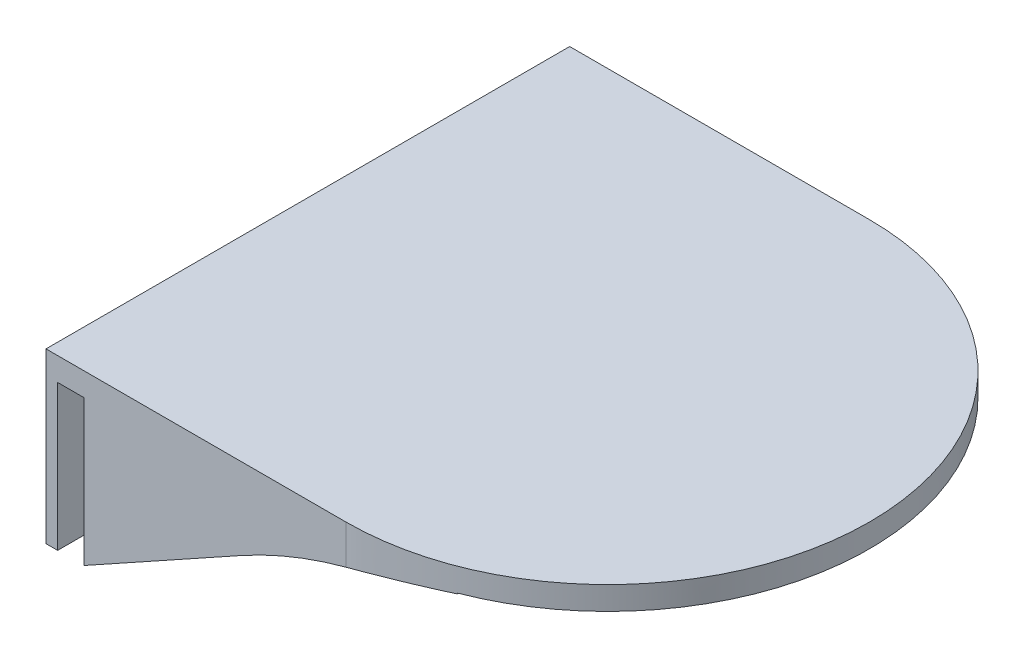
ISO-10303-21;
HEADER;
FILE_DESCRIPTION(('STEP AP214'),'2;1');
FILE_NAME('part.step','',(''),(''),'','','');
FILE_SCHEMA(('AUTOMOTIVE_DESIGN { 1 0 10303 214 1 1 1 1 }'));
ENDSEC;
DATA;
#1=APPLICATION_CONTEXT('core data for automotive mechanical design processes');
#2=APPLICATION_PROTOCOL_DEFINITION('international standard','automotive_design',2000,#1);
#3=PRODUCT_CONTEXT('',#1,'mechanical');
#4=PRODUCT('Part','Part','',(#3));
#5=PRODUCT_RELATED_PRODUCT_CATEGORY('part','',(#4));
#6=PRODUCT_DEFINITION_FORMATION('','',#4);
#7=PRODUCT_DEFINITION_CONTEXT('part definition',#1,'design');
#8=PRODUCT_DEFINITION('design','',#6,#7);
#9=PRODUCT_DEFINITION_SHAPE('','',#8);
#10=(LENGTH_UNIT() NAMED_UNIT(*) SI_UNIT(.MILLI.,.METRE.));
#11=(NAMED_UNIT(*) PLANE_ANGLE_UNIT() SI_UNIT($,.RADIAN.));
#12=(NAMED_UNIT(*) SI_UNIT($,.STERADIAN.) SOLID_ANGLE_UNIT());
#13=UNCERTAINTY_MEASURE_WITH_UNIT(LENGTH_MEASURE(1.E-05),#10,'distance_accuracy_value','');
#14=(GEOMETRIC_REPRESENTATION_CONTEXT(3) GLOBAL_UNCERTAINTY_ASSIGNED_CONTEXT((#13)) GLOBAL_UNIT_ASSIGNED_CONTEXT((#10,
#11,#12)) REPRESENTATION_CONTEXT('',''));
#15=CARTESIAN_POINT('',(0.,0.,0.));
#16=DIRECTION('',(0.,0.,1.));
#17=DIRECTION('',(1.,0.,0.));
#18=AXIS2_PLACEMENT_3D('',#15,#16,#17);
#19=CARTESIAN_POINT('',(-90.0820393249937,0.,-208.278936550003));
#20=DIRECTION('',(-1.,0.,0.));
#21=DIRECTION('',(0.,0.,1.));
#22=AXIS2_PLACEMENT_3D('',#19,#20,#21);
#23=PLANE('',#22);
#24=DIRECTION('',(0.,1.,0.));
#25=VECTOR('',#24,1.);
#26=CARTESIAN_POINT('',(-90.0820393249937,0.,-84.));
#27=LINE('',#26,#25);
#28=CARTESIAN_POINT('',(-90.0820393249937,-50.,-84.));
#29=VERTEX_POINT('',#28);
#30=CARTESIAN_POINT('',(-90.0820393249937,0.,-84.));
#31=VERTEX_POINT('',#30);
#32=EDGE_CURVE('E139',#29,#31,#27,.T.);
#33=ORIENTED_EDGE('',*,*,#32,.T.);
#34=DIRECTION('',(0.,0.,1.));
#35=VECTOR('',#34,1.);
#36=CARTESIAN_POINT('',(-90.0820393249937,0.,-208.278936550003));
#37=LINE('',#36,#35);
#38=CARTESIAN_POINT('',(-90.0820393249937,0.,-90.));
#39=VERTEX_POINT('',#38);
#40=EDGE_CURVE('E168',#39,#31,#37,.T.);
#41=ORIENTED_EDGE('',*,*,#40,.F.);
#42=DIRECTION('',(0.,1.,0.));
#43=VECTOR('',#42,1.);
#44=CARTESIAN_POINT('',(-90.0820393249937,0.,-90.));
#45=LINE('',#44,#43);
#46=CARTESIAN_POINT('',(-90.0820393249937,-50.,-90.));
#47=VERTEX_POINT('',#46);
#48=EDGE_CURVE('E161',#47,#39,#45,.T.);
#49=ORIENTED_EDGE('',*,*,#48,.F.);
#50=DIRECTION('',(0.,0.,1.));
#51=VECTOR('',#50,1.);
#52=CARTESIAN_POINT('',(-90.0820393249937,-50.,-208.278936550003));
#53=LINE('',#52,#51);
#54=EDGE_CURVE('E154',#47,#29,#53,.T.);
#55=ORIENTED_EDGE('',*,*,#54,.T.);
#56=EDGE_LOOP('',(#33,#41,#49,#55));
#57=FACE_BOUND('',#56,.T.);
#58=ADVANCED_FACE('F37',(#57),#23,.T.);
#59=CARTESIAN_POINT('',(-90.0820393249937,-50.,-208.278936550003));
#60=DIRECTION('',(0.485304850770635,-0.87434501303461,0.));
#61=DIRECTION('',(0.87434501303461,0.485304850770635,0.));
#62=AXIS2_PLACEMENT_3D('',#59,#60,#61);
#63=PLANE('',#62);
#64=DIRECTION('',(-0.87434501303461,-0.485304850770635,0.));
#65=VECTOR('',#64,1.);
#66=CARTESIAN_POINT('',(-90.0820393249937,-50.,-90.));
#67=LINE('',#66,#65);
#68=CARTESIAN_POINT('',(-36.2216239270331,-20.1047979144624,-90.));
#69=VERTEX_POINT('',#68);
#70=EDGE_CURVE('E196',#69,#47,#67,.T.);
#71=ORIENTED_EDGE('',*,*,#70,.F.);
#72=DIRECTION('',(0.,0.,1.));
#73=VECTOR('',#72,1.);
#74=CARTESIAN_POINT('',(-36.2216239270331,-20.1047979144624,-208.278936550003));
#75=LINE('',#74,#73);
#76=CARTESIAN_POINT('',(-36.2216239270331,-20.1047979144624,-84.));
#77=VERTEX_POINT('',#76);
#78=EDGE_CURVE('E156',#69,#77,#75,.T.);
#79=ORIENTED_EDGE('',*,*,#78,.T.);
#80=DIRECTION('',(0.87434501303461,0.485304850770635,0.));
#81=VECTOR('',#80,1.);
#82=CARTESIAN_POINT('',(-90.0820393249937,-50.,-84.));
#83=LINE('',#82,#81);
#84=EDGE_CURVE('E142',#29,#77,#83,.T.);
#85=ORIENTED_EDGE('',*,*,#84,.F.);
#86=ORIENTED_EDGE('',*,*,#54,.F.);
#87=EDGE_LOOP('',(#71,#79,#85,#86));
#88=FACE_BOUND('',#87,.T.);
#89=ADVANCED_FACE('F153',(#88),#63,.T.);
#90=CARTESIAN_POINT('',(0.,8.,0.));
#91=DIRECTION('',(0.,-1.,0.));
#92=DIRECTION('',(0.,0.,-1.));
#93=AXIS2_PLACEMENT_3D('',#90,#91,#92);
#94=CYLINDRICAL_SURFACE('',#93,90.);
#95=DIRECTION('',(0.,-1.,0.));
#96=VECTOR('',#95,1.);
#97=CARTESIAN_POINT('',(0.,8.,90.));
#98=LINE('',#97,#96);
#99=CARTESIAN_POINT('',(0.,8.,90.));
#100=VERTEX_POINT('',#99);
#101=CARTESIAN_POINT('',(0.,-5.45618400949456,90.));
#102=VERTEX_POINT('',#101);
#103=EDGE_CURVE('E57',#100,#102,#98,.T.);
#104=ORIENTED_EDGE('',*,*,#103,.T.);
#105=CARTESIAN_POINT('',(0.,-5.45618400949456,90.));
#106=CARTESIAN_POINT('',(0.676579032918027,-5.27481793973442,90.0000005999302));
#107=CARTESIAN_POINT('',(1.3543216190302,-5.09790618018332,89.9923700488413));
#108=CARTESIAN_POINT('',(2.71175054397955,-4.7530740532775,89.9616992498719));
#109=CARTESIAN_POINT('',(3.39143690525018,-4.58515379013996,89.938658823423));
#110=CARTESIAN_POINT('',(5.43276961012315,-4.09502098527022,89.8462038634848));
#111=CARTESIAN_POINT('',(6.79673280708392,-3.78642484166299,89.7534556682142));
#112=CARTESIAN_POINT('',(9.51187896592084,-3.20930838894645,89.5062146375457));
#113=CARTESIAN_POINT('',(10.8630398932317,-2.94038932600334,89.3524031462073));
#114=CARTESIAN_POINT('',(13.563562177461,-2.43888090337245,88.982509619888));
#115=CARTESIAN_POINT('',(14.9129235873578,-2.20629044965611,88.766429460673));
#116=CARTESIAN_POINT('',(17.6120449134313,-1.77637143924052,88.2706470579383));
#117=CARTESIAN_POINT('',(18.9617789381,-1.57920741285122,87.9906610059642));
#118=CARTESIAN_POINT('',(21.6514911165541,-1.22102112115672,87.3677214440218));
#119=CARTESIAN_POINT('',(22.9914690357166,-1.05999972227997,87.0247664248895));
#120=CARTESIAN_POINT('',(25.6724294002178,-0.771780067179688,86.2721614615952));
#121=CARTESIAN_POINT('',(27.0132602687289,-0.644973990699274,85.8618183553604));
#122=CARTESIAN_POINT('',(29.0108008517467,-0.48109538342923,85.1989782895893));
#123=CARTESIAN_POINT('',(29.674389176877,-0.430856145313428,84.9701341322484));
#124=CARTESIAN_POINT('',(30.9965531919549,-0.338978536110794,84.4967852121419));
#125=CARTESIAN_POINT('',(31.655128908226,-0.297340119827178,84.2522805316802));
#126=CARTESIAN_POINT('',(32.3109888428071,-0.259912464926287,84.));
#127=B_SPLINE_CURVE_WITH_KNOTS('',3,(#105,#106,#107,#108,#109,#110,#111,#112,#113,#114,#115,
#116,#117,#118,#119,#120,#121,#122,#123,#124,#125,#126),.UNSPECIFIED.,.F.,.F.,(4,2,2,2,2,2,2,2,
2,2,4),(0.,2.10128105442194,4.20258645876373,8.40506315411791,12.5619102736507,16.718632186445,
20.8941863799632,25.0698406611863,29.2914988320922,31.4024934694823,33.5134770134444),.UNSPECIFIED.);
#128=CARTESIAN_POINT('',(32.3109888428071,-0.259912464926287,84.));
#129=VERTEX_POINT('',#128);
#130=EDGE_CURVE('E53',#102,#129,#127,.T.);
#131=ORIENTED_EDGE('',*,*,#130,.T.);
#132=DIRECTION('',(0.,-1.,0.));
#133=VECTOR('',#132,1.);
#134=CARTESIAN_POINT('',(32.3109888428071,-0.259912464926287,84.));
#135=LINE('',#134,#133);
#136=CARTESIAN_POINT('',(32.310988842807,0.,84.));
#137=VERTEX_POINT('',#136);
#138=EDGE_CURVE('E11',#137,#129,#135,.T.);
#139=ORIENTED_EDGE('',*,*,#138,.F.);
#140=CARTESIAN_POINT('',(0.,0.,0.));
#141=DIRECTION('',(0.,1.,0.));
#142=DIRECTION('',(0.,0.,1.));
#143=AXIS2_PLACEMENT_3D('',#140,#141,#142);
#144=CIRCLE('',#143,90.);
#145=CARTESIAN_POINT('',(32.310988842807,0.,-84.));
#146=VERTEX_POINT('',#145);
#147=EDGE_CURVE('E192',#137,#146,#144,.T.);
#148=ORIENTED_EDGE('',*,*,#147,.T.);
#149=DIRECTION('',(0.,-1.,0.));
#150=VECTOR('',#149,1.);
#151=CARTESIAN_POINT('',(32.310988842807,0.,-84.));
#152=LINE('',#151,#150);
#153=CARTESIAN_POINT('',(32.310988842807,-0.259912464926293,-84.));
#154=VERTEX_POINT('',#153);
#155=EDGE_CURVE('E46',#146,#154,#152,.T.);
#156=ORIENTED_EDGE('',*,*,#155,.T.);
#157=CARTESIAN_POINT('',(32.310988842807,-0.259912464926293,-84.));
#158=CARTESIAN_POINT('',(31.6586132645872,-0.297141300308556,-84.2509402406203));
#159=CARTESIAN_POINT('',(31.0035505188139,-0.338536252174855,-84.4941871180927));
#160=CARTESIAN_POINT('',(29.6884630674686,-0.429834885303179,-84.9651870305295));
#161=CARTESIAN_POINT('',(29.0284383364911,-0.479738610158548,-85.1929399861049));
#162=CARTESIAN_POINT('',(27.0416561542902,-0.642468346147607,-85.8527582359676));
#163=CARTESIAN_POINT('',(25.708085825319,-0.76831884020531,-86.2614232426045));
#164=CARTESIAN_POINT('',(23.0415962502401,-1.05425433048062,-87.0113926254637));
#165=CARTESIAN_POINT('',(21.7088266773,-1.21395339872803,-87.3533792303636));
#166=CARTESIAN_POINT('',(19.0335672266561,-1.56910664533061,-87.9750478400376));
#167=CARTESIAN_POINT('',(17.6910775487895,-1.76456009059868,-88.2547311219825));
#168=CARTESIAN_POINT('',(14.9922032065415,-2.19292939180993,-88.7531874216309));
#169=CARTESIAN_POINT('',(13.6357835676672,-2.42606401081324,-88.9715830329337));
#170=CARTESIAN_POINT('',(10.9210592454245,-2.92904730766714,-89.3454421527348));
#171=CARTESIAN_POINT('',(9.56275449959963,-3.19889723215501,-89.5009035236412));
#172=CARTESIAN_POINT('',(6.83314199632696,-3.77829170371481,-89.7508044144565));
#173=CARTESIAN_POINT('',(5.46185616122373,-4.08824143717938,-89.8445515965929));
#174=CARTESIAN_POINT('',(3.4095771462398,-4.58069847505118,-89.9380007681842));
#175=CARTESIAN_POINT('',(2.72624919257671,-4.74944221517535,-89.9612885540912));
#176=CARTESIAN_POINT('',(1.3615555566589,-5.09601802449676,-89.992288382665));
#177=CARTESIAN_POINT('',(0.680189851295643,-5.27384998619986,-90.0000006095135));
#178=CARTESIAN_POINT('',(0.,-5.45618400949452,-90.));
#179=B_SPLINE_CURVE_WITH_KNOTS('',3,(#157,#158,#159,#160,#161,#162,#163,#164,#165,#166,#167,
#168,#169,#170,#171,#172,#173,#174,#175,#176,#177,#178),.UNSPECIFIED.,.F.,.F.,(4,2,2,2,2,2,2,2,
2,2,4),(0.,2.09976997714388,4.19955071244834,8.39877501346071,12.5524754254537,16.706090681915,
20.884748876584,25.0635489894962,29.2884641666884,31.4009832078621,33.5134772682542),.UNSPECIFIED.);
#180=CARTESIAN_POINT('',(0.,-5.45618400949452,-90.));
#181=VERTEX_POINT('',#180);
#182=EDGE_CURVE('E215',#154,#181,#179,.T.);
#183=ORIENTED_EDGE('',*,*,#182,.T.);
#184=DIRECTION('',(0.,-1.,0.));
#185=VECTOR('',#184,1.);
#186=CARTESIAN_POINT('',(0.,8.,-90.));
#187=LINE('',#186,#185);
#188=CARTESIAN_POINT('',(0.,8.,-90.));
#189=VERTEX_POINT('',#188);
#190=EDGE_CURVE('E206',#189,#181,#187,.T.);
#191=ORIENTED_EDGE('',*,*,#190,.F.);
#192=CARTESIAN_POINT('',(0.,8.,0.));
#193=DIRECTION('',(0.,1.,0.));
#194=DIRECTION('',(0.,0.,1.));
#195=AXIS2_PLACEMENT_3D('',#192,#193,#194);
#196=CIRCLE('',#195,90.);
#197=EDGE_CURVE('E182',#100,#189,#196,.T.);
#198=ORIENTED_EDGE('',*,*,#197,.F.);
#199=EDGE_LOOP('',(#104,#131,#139,#148,#156,#183,#191,#198));
#200=FACE_BOUND('',#199,.T.);
#201=ADVANCED_FACE('F225',(#200),#94,.T.);
#202=CARTESIAN_POINT('',(0.,8.,-90.));
#203=DIRECTION('',(0.,0.,1.));
#204=DIRECTION('',(1.,0.,0.));
#205=AXIS2_PLACEMENT_3D('',#202,#203,#204);
#206=PLANE('',#205);
#207=ORIENTED_EDGE('',*,*,#190,.T.);
#208=CARTESIAN_POINT('',(41.4271521962684,-160.,-90.));
#209=DIRECTION('',(0.,0.,1.));
#210=DIRECTION('',(1.,0.,0.));
#211=AXIS2_PLACEMENT_3D('',#208,#209,#210);
#212=CIRCLE('',#211,160.);
#213=EDGE_CURVE('E223',#181,#69,#212,.T.);
#214=ORIENTED_EDGE('',*,*,#213,.T.);
#215=ORIENTED_EDGE('',*,*,#70,.T.);
#216=ORIENTED_EDGE('',*,*,#48,.T.);
#217=DIRECTION('',(-1.,0.,0.));
#218=VECTOR('',#217,1.);
#219=CARTESIAN_POINT('',(0.,0.,-90.));
#220=LINE('',#219,#218);
#221=CARTESIAN_POINT('',(-99.0820393249937,0.,-90.));
#222=VERTEX_POINT('',#221);
#223=EDGE_CURVE('E195',#39,#222,#220,.T.);
#224=ORIENTED_EDGE('',*,*,#223,.T.);
#225=DIRECTION('',(0.,-1.,0.));
#226=VECTOR('',#225,1.);
#227=CARTESIAN_POINT('',(-99.0820393249937,-50.,-90.));
#228=LINE('',#227,#226);
#229=CARTESIAN_POINT('',(-99.0820393249937,-50.,-90.));
#230=VERTEX_POINT('',#229);
#231=EDGE_CURVE('E166',#222,#230,#228,.T.);
#232=ORIENTED_EDGE('',*,*,#231,.T.);
#233=DIRECTION('',(-1.,0.,0.));
#234=VECTOR('',#233,1.);
#235=CARTESIAN_POINT('',(-103.082039324994,-50.,-90.));
#236=LINE('',#235,#234);
#237=CARTESIAN_POINT('',(-103.082039324994,-50.,-90.));
#238=VERTEX_POINT('',#237);
#239=EDGE_CURVE('E162',#230,#238,#236,.T.);
#240=ORIENTED_EDGE('',*,*,#239,.T.);
#241=DIRECTION('',(0.,-1.,0.));
#242=VECTOR('',#241,1.);
#243=CARTESIAN_POINT('',(-103.082039324994,8.,-90.));
#244=LINE('',#243,#242);
#245=CARTESIAN_POINT('',(-103.082039324994,8.,-90.));
#246=VERTEX_POINT('',#245);
#247=EDGE_CURVE('E204',#246,#238,#244,.T.);
#248=ORIENTED_EDGE('',*,*,#247,.F.);
#249=DIRECTION('',(-1.,0.,0.));
#250=VECTOR('',#249,1.);
#251=CARTESIAN_POINT('',(0.,8.,-90.));
#252=LINE('',#251,#250);
#253=EDGE_CURVE('E185',#189,#246,#252,.T.);
#254=ORIENTED_EDGE('',*,*,#253,.F.);
#255=EDGE_LOOP('',(#207,#214,#215,#216,#224,#232,#240,#248,#254));
#256=FACE_BOUND('',#255,.T.);
#257=ADVANCED_FACE('F304',(#256),#206,.F.);
#258=CARTESIAN_POINT('',(-103.082039324994,8.,-90.));
#259=DIRECTION('',(1.,0.,0.));
#260=DIRECTION('',(0.,0.,-1.));
#261=AXIS2_PLACEMENT_3D('',#258,#259,#260);
#262=PLANE('',#261);
#263=ORIENTED_EDGE('',*,*,#247,.T.);
#264=DIRECTION('',(0.,0.,1.));
#265=VECTOR('',#264,1.);
#266=CARTESIAN_POINT('',(-103.082039324994,-50.,-208.278936550003));
#267=LINE('',#266,#265);
#268=CARTESIAN_POINT('',(-103.082039324994,-50.,90.));
#269=VERTEX_POINT('',#268);
#270=EDGE_CURVE('E179',#238,#269,#267,.T.);
#271=ORIENTED_EDGE('',*,*,#270,.T.);
#272=DIRECTION('',(0.,-1.,0.));
#273=VECTOR('',#272,1.);
#274=CARTESIAN_POINT('',(-103.082039324994,8.,90.));
#275=LINE('',#274,#273);
#276=CARTESIAN_POINT('',(-103.082039324994,8.,90.));
#277=VERTEX_POINT('',#276);
#278=EDGE_CURVE('E202',#277,#269,#275,.T.);
#279=ORIENTED_EDGE('',*,*,#278,.F.);
#280=DIRECTION('',(0.,0.,1.));
#281=VECTOR('',#280,1.);
#282=CARTESIAN_POINT('',(-103.082039324994,8.,-90.));
#283=LINE('',#282,#281);
#284=EDGE_CURVE('E188',#246,#277,#283,.T.);
#285=ORIENTED_EDGE('',*,*,#284,.F.);
#286=EDGE_LOOP('',(#263,#271,#279,#285));
#287=FACE_BOUND('',#286,.T.);
#288=ADVANCED_FACE('F314',(#287),#262,.F.);
#289=CARTESIAN_POINT('',(0.,8.,90.));
#290=DIRECTION('',(0.,0.,-1.));
#291=DIRECTION('',(-1.,0.,0.));
#292=AXIS2_PLACEMENT_3D('',#289,#290,#291);
#293=PLANE('',#292);
#294=ORIENTED_EDGE('',*,*,#278,.T.);
#295=DIRECTION('',(1.,0.,0.));
#296=VECTOR('',#295,1.);
#297=CARTESIAN_POINT('',(-103.082039324994,-50.,90.));
#298=LINE('',#297,#296);
#299=CARTESIAN_POINT('',(-99.0820393249937,-50.,90.));
#300=VERTEX_POINT('',#299);
#301=EDGE_CURVE('E269',#269,#300,#298,.T.);
#302=ORIENTED_EDGE('',*,*,#301,.T.);
#303=DIRECTION('',(0.,1.,0.));
#304=VECTOR('',#303,1.);
#305=CARTESIAN_POINT('',(-99.0820393249937,-50.,90.));
#306=LINE('',#305,#304);
#307=CARTESIAN_POINT('',(-99.0820393249937,0.,90.));
#308=VERTEX_POINT('',#307);
#309=EDGE_CURVE('E281',#300,#308,#306,.T.);
#310=ORIENTED_EDGE('',*,*,#309,.T.);
#311=DIRECTION('',(1.,0.,0.));
#312=VECTOR('',#311,1.);
#313=CARTESIAN_POINT('',(0.,0.,90.));
#314=LINE('',#313,#312);
#315=CARTESIAN_POINT('',(-90.0820393249937,0.,90.));
#316=VERTEX_POINT('',#315);
#317=EDGE_CURVE('E186',#308,#316,#314,.T.);
#318=ORIENTED_EDGE('',*,*,#317,.T.);
#319=DIRECTION('',(0.,-1.,0.));
#320=VECTOR('',#319,1.);
#321=CARTESIAN_POINT('',(-90.0820393249937,0.,90.));
#322=LINE('',#321,#320);
#323=CARTESIAN_POINT('',(-90.0820393249937,-50.,90.));
#324=VERTEX_POINT('',#323);
#325=EDGE_CURVE('E277',#316,#324,#322,.T.);
#326=ORIENTED_EDGE('',*,*,#325,.T.);
#327=DIRECTION('',(0.87434501303461,0.485304850770635,0.));
#328=VECTOR('',#327,1.);
#329=CARTESIAN_POINT('',(-90.0820393249937,-50.,90.));
#330=LINE('',#329,#328);
#331=CARTESIAN_POINT('',(-36.2216239270331,-20.1047979144624,90.));
#332=VERTEX_POINT('',#331);
#333=EDGE_CURVE('E171',#324,#332,#330,.T.);
#334=ORIENTED_EDGE('',*,*,#333,.T.);
#335=CARTESIAN_POINT('',(41.4271521962684,-160.,90.));
#336=DIRECTION('',(0.,0.,-1.));
#337=DIRECTION('',(-1.,0.,0.));
#338=AXIS2_PLACEMENT_3D('',#335,#336,#337);
#339=CIRCLE('',#338,160.);
#340=EDGE_CURVE('E302',#332,#102,#339,.T.);
#341=ORIENTED_EDGE('',*,*,#340,.T.);
#342=ORIENTED_EDGE('',*,*,#103,.F.);
#343=DIRECTION('',(1.,0.,0.));
#344=VECTOR('',#343,1.);
#345=CARTESIAN_POINT('',(0.,8.,90.));
#346=LINE('',#345,#344);
#347=EDGE_CURVE('E190',#277,#100,#346,.T.);
#348=ORIENTED_EDGE('',*,*,#347,.F.);
#349=EDGE_LOOP('',(#294,#302,#310,#318,#326,#334,#341,#342,#348));
#350=FACE_BOUND('',#349,.T.);
#351=ADVANCED_FACE('F278',(#350),#293,.F.);
#352=CARTESIAN_POINT('',(0.,8.,0.));
#353=DIRECTION('',(0.,1.,0.));
#354=DIRECTION('',(0.,0.,1.));
#355=AXIS2_PLACEMENT_3D('',#352,#353,#354);
#356=PLANE('',#355);
#357=ORIENTED_EDGE('',*,*,#197,.T.);
#358=ORIENTED_EDGE('',*,*,#253,.T.);
#359=ORIENTED_EDGE('',*,*,#284,.T.);
#360=ORIENTED_EDGE('',*,*,#347,.T.);
#361=EDGE_LOOP('',(#357,#358,#359,#360));
#362=FACE_BOUND('',#361,.T.);
#363=ADVANCED_FACE('F259',(#362),#356,.T.);
#364=CARTESIAN_POINT('',(0.,0.,0.));
#365=DIRECTION('',(0.,1.,0.));
#366=DIRECTION('',(0.,0.,1.));
#367=AXIS2_PLACEMENT_3D('',#364,#365,#366);
#368=PLANE('',#367);
#369=DIRECTION('',(1.,0.,0.));
#370=VECTOR('',#369,1.);
#371=CARTESIAN_POINT('',(-265.364668241838,0.,-84.));
#372=LINE('',#371,#370);
#373=EDGE_CURVE('E144',#31,#146,#372,.T.);
#374=ORIENTED_EDGE('',*,*,#373,.T.);
#375=ORIENTED_EDGE('',*,*,#147,.F.);
#376=DIRECTION('',(1.,0.,0.));
#377=VECTOR('',#376,1.);
#378=CARTESIAN_POINT('',(-265.364668241838,0.,84.));
#379=LINE('',#378,#377);
#380=CARTESIAN_POINT('',(-90.0820393249937,0.,84.));
#381=VERTEX_POINT('',#380);
#382=EDGE_CURVE('E270',#381,#137,#379,.T.);
#383=ORIENTED_EDGE('',*,*,#382,.F.);
#384=EDGE_CURVE('E174',#381,#316,#37,.T.);
#385=ORIENTED_EDGE('',*,*,#384,.T.);
#386=ORIENTED_EDGE('',*,*,#317,.F.);
#387=DIRECTION('',(0.,0.,1.));
#388=VECTOR('',#387,1.);
#389=CARTESIAN_POINT('',(-99.0820393249937,0.,-208.278936550003));
#390=LINE('',#389,#388);
#391=EDGE_CURVE('E175',#222,#308,#390,.T.);
#392=ORIENTED_EDGE('',*,*,#391,.F.);
#393=ORIENTED_EDGE('',*,*,#223,.F.);
#394=ORIENTED_EDGE('',*,*,#40,.T.);
#395=EDGE_LOOP('',(#374,#375,#383,#385,#386,#392,#393,#394));
#396=FACE_BOUND('',#395,.T.);
#397=ADVANCED_FACE('F251',(#396),#368,.F.);
#398=DIRECTION('',(0.,-1.,0.));
#399=VECTOR('',#398,1.);
#400=CARTESIAN_POINT('',(-90.0820393249937,0.,84.));
#401=LINE('',#400,#399);
#402=CARTESIAN_POINT('',(-90.0820393249937,-50.,84.));
#403=VERTEX_POINT('',#402);
#404=EDGE_CURVE('E264',#381,#403,#401,.T.);
#405=ORIENTED_EDGE('',*,*,#404,.T.);
#406=EDGE_CURVE('E163',#403,#324,#53,.T.);
#407=ORIENTED_EDGE('',*,*,#406,.T.);
#408=ORIENTED_EDGE('',*,*,#325,.F.);
#409=ORIENTED_EDGE('',*,*,#384,.F.);
#410=EDGE_LOOP('',(#405,#407,#408,#409));
#411=FACE_BOUND('',#410,.T.);
#412=ADVANCED_FACE('F243',(#411),#23,.T.);
#413=DIRECTION('',(-0.87434501303461,-0.485304850770635,0.));
#414=VECTOR('',#413,1.);
#415=CARTESIAN_POINT('',(-90.0820393249937,-50.,84.));
#416=LINE('',#415,#414);
#417=CARTESIAN_POINT('',(-36.2216239270331,-20.1047979144624,84.));
#418=VERTEX_POINT('',#417);
#419=EDGE_CURVE('E157',#418,#403,#416,.T.);
#420=ORIENTED_EDGE('',*,*,#419,.F.);
#421=DIRECTION('',(0.,0.,1.));
#422=VECTOR('',#421,1.);
#423=CARTESIAN_POINT('',(-36.2216239270331,-20.1047979144624,-208.278936550003));
#424=LINE('',#423,#422);
#425=EDGE_CURVE('E210',#418,#332,#424,.T.);
#426=ORIENTED_EDGE('',*,*,#425,.T.);
#427=ORIENTED_EDGE('',*,*,#333,.F.);
#428=ORIENTED_EDGE('',*,*,#406,.F.);
#429=EDGE_LOOP('',(#420,#426,#427,#428));
#430=FACE_BOUND('',#429,.T.);
#431=ADVANCED_FACE('F248',(#430),#63,.T.);
#432=CARTESIAN_POINT('',(-99.0820393249937,-50.,-208.278936550003));
#433=DIRECTION('',(1.,0.,0.));
#434=DIRECTION('',(0.,0.,-1.));
#435=AXIS2_PLACEMENT_3D('',#432,#433,#434);
#436=PLANE('',#435);
#437=ORIENTED_EDGE('',*,*,#231,.F.);
#438=ORIENTED_EDGE('',*,*,#391,.T.);
#439=ORIENTED_EDGE('',*,*,#309,.F.);
#440=DIRECTION('',(0.,0.,1.));
#441=VECTOR('',#440,1.);
#442=CARTESIAN_POINT('',(-99.0820393249937,-50.,-208.278936550003));
#443=LINE('',#442,#441);
#444=EDGE_CURVE('E177',#230,#300,#443,.T.);
#445=ORIENTED_EDGE('',*,*,#444,.F.);
#446=EDGE_LOOP('',(#437,#438,#439,#445));
#447=FACE_BOUND('',#446,.T.);
#448=ADVANCED_FACE('F257',(#447),#436,.T.);
#449=CARTESIAN_POINT('',(-103.082039324994,-50.,-208.278936550003));
#450=DIRECTION('',(0.,-1.,0.));
#451=DIRECTION('',(0.,0.,-1.));
#452=AXIS2_PLACEMENT_3D('',#449,#450,#451);
#453=PLANE('',#452);
#454=ORIENTED_EDGE('',*,*,#239,.F.);
#455=ORIENTED_EDGE('',*,*,#444,.T.);
#456=ORIENTED_EDGE('',*,*,#301,.F.);
#457=ORIENTED_EDGE('',*,*,#270,.F.);
#458=EDGE_LOOP('',(#454,#455,#456,#457));
#459=FACE_BOUND('',#458,.T.);
#460=ADVANCED_FACE('F317',(#459),#453,.T.);
#461=CARTESIAN_POINT('',(-265.364668241838,0.,-84.));
#462=DIRECTION('',(0.,0.,-1.));
#463=DIRECTION('',(-1.,0.,0.));
#464=AXIS2_PLACEMENT_3D('',#461,#462,#463);
#465=PLANE('',#464);
#466=ORIENTED_EDGE('',*,*,#84,.T.);
#467=CARTESIAN_POINT('',(41.4271521962684,-160.,-84.));
#468=DIRECTION('',(0.,0.,-1.));
#469=DIRECTION('',(-1.,0.,0.));
#470=AXIS2_PLACEMENT_3D('',#467,#468,#469);
#471=CIRCLE('',#470,160.);
#472=EDGE_CURVE('E213',#77,#154,#471,.T.);
#473=ORIENTED_EDGE('',*,*,#472,.T.);
#474=ORIENTED_EDGE('',*,*,#155,.F.);
#475=ORIENTED_EDGE('',*,*,#373,.F.);
#476=ORIENTED_EDGE('',*,*,#32,.F.);
#477=EDGE_LOOP('',(#466,#473,#474,#475,#476));
#478=FACE_BOUND('',#477,.T.);
#479=ADVANCED_FACE('F141',(#478),#465,.F.);
#480=CARTESIAN_POINT('',(-265.364668241838,0.,84.));
#481=DIRECTION('',(0.,0.,1.));
#482=DIRECTION('',(1.,0.,0.));
#483=AXIS2_PLACEMENT_3D('',#480,#481,#482);
#484=PLANE('',#483);
#485=ORIENTED_EDGE('',*,*,#382,.T.);
#486=ORIENTED_EDGE('',*,*,#138,.T.);
#487=CARTESIAN_POINT('',(41.4271521962684,-160.,84.));
#488=DIRECTION('',(0.,0.,1.));
#489=DIRECTION('',(1.,0.,0.));
#490=AXIS2_PLACEMENT_3D('',#487,#488,#489);
#491=CIRCLE('',#490,160.);
#492=EDGE_CURVE('E295',#129,#418,#491,.T.);
#493=ORIENTED_EDGE('',*,*,#492,.T.);
#494=ORIENTED_EDGE('',*,*,#419,.T.);
#495=ORIENTED_EDGE('',*,*,#404,.F.);
#496=EDGE_LOOP('',(#485,#486,#493,#494,#495));
#497=FACE_BOUND('',#496,.T.);
#498=ADVANCED_FACE('F231',(#497),#484,.F.);
#499=CARTESIAN_POINT('',(41.4271521962684,-160.,-208.278936550003));
#500=DIRECTION('',(0.,0.,1.));
#501=DIRECTION('',(1.,0.,0.));
#502=AXIS2_PLACEMENT_3D('',#499,#500,#501);
#503=CYLINDRICAL_SURFACE('',#502,160.);
#504=ORIENTED_EDGE('',*,*,#213,.F.);
#505=ORIENTED_EDGE('',*,*,#182,.F.);
#506=ORIENTED_EDGE('',*,*,#472,.F.);
#507=ORIENTED_EDGE('',*,*,#78,.F.);
#508=EDGE_LOOP('',(#504,#505,#506,#507));
#509=FACE_BOUND('',#508,.T.);
#510=ADVANCED_FACE('F228',(#509),#503,.F.);
#511=CARTESIAN_POINT('',(41.4271521962684,-160.,-208.278936550003));
#512=DIRECTION('',(0.,0.,1.));
#513=DIRECTION('',(1.,0.,0.));
#514=AXIS2_PLACEMENT_3D('',#511,#512,#513);
#515=CYLINDRICAL_SURFACE('',#514,160.);
#516=ORIENTED_EDGE('',*,*,#492,.F.);
#517=ORIENTED_EDGE('',*,*,#130,.F.);
#518=ORIENTED_EDGE('',*,*,#340,.F.);
#519=ORIENTED_EDGE('',*,*,#425,.F.);
#520=EDGE_LOOP('',(#516,#517,#518,#519));
#521=FACE_BOUND('',#520,.T.);
#522=ADVANCED_FACE('F39',(#521),#515,.F.);
#523=CLOSED_SHELL('',(#58,#89,#201,#257,#288,#351,#363,#397,#412,#431,#448,#460,#479,#498,#510,#522));
#524=MANIFOLD_SOLID_BREP('B2',#523);
#525=ADVANCED_BREP_SHAPE_REPRESENTATION('',(#18,#524),#14);
#526=SHAPE_DEFINITION_REPRESENTATION(#9,#525);
ENDSEC;
END-ISO-10303-21;
